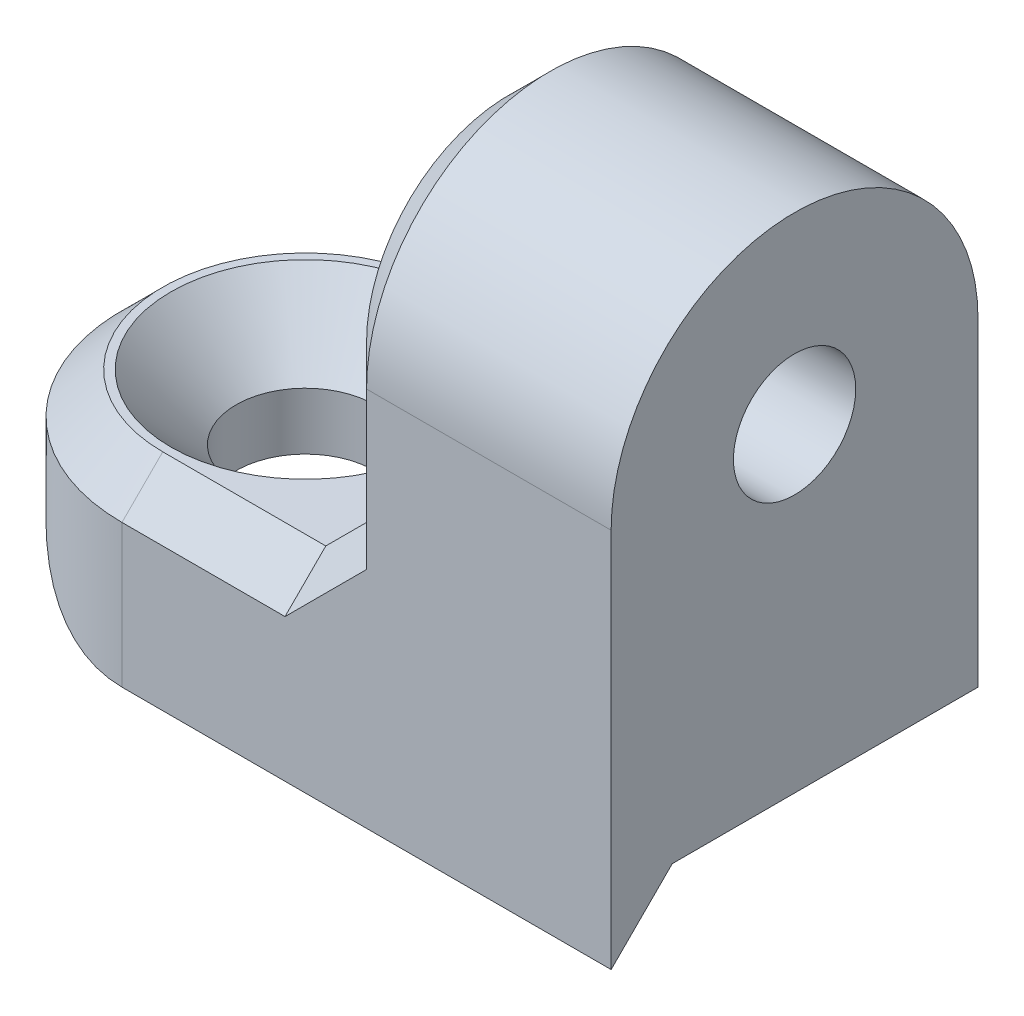
ISO-10303-21;
HEADER;
FILE_DESCRIPTION(('STEP AP214'),'2;1');
FILE_NAME('part.step','',(''),(''),'','','');
FILE_SCHEMA(('AUTOMOTIVE_DESIGN { 1 0 10303 214 1 1 1 1 }'));
ENDSEC;
DATA;
#1=APPLICATION_CONTEXT('core data for automotive mechanical design processes');
#2=APPLICATION_PROTOCOL_DEFINITION('international standard','automotive_design',2000,#1);
#3=PRODUCT_CONTEXT('',#1,'mechanical');
#4=PRODUCT('Part','Part','',(#3));
#5=PRODUCT_RELATED_PRODUCT_CATEGORY('part','',(#4));
#6=PRODUCT_DEFINITION_FORMATION('','',#4);
#7=PRODUCT_DEFINITION_CONTEXT('part definition',#1,'design');
#8=PRODUCT_DEFINITION('design','',#6,#7);
#9=PRODUCT_DEFINITION_SHAPE('','',#8);
#10=(LENGTH_UNIT() NAMED_UNIT(*) SI_UNIT(.MILLI.,.METRE.));
#11=(NAMED_UNIT(*) PLANE_ANGLE_UNIT() SI_UNIT($,.RADIAN.));
#12=(NAMED_UNIT(*) SI_UNIT($,.STERADIAN.) SOLID_ANGLE_UNIT());
#13=UNCERTAINTY_MEASURE_WITH_UNIT(LENGTH_MEASURE(1.E-05),#10,'distance_accuracy_value','');
#14=(GEOMETRIC_REPRESENTATION_CONTEXT(3) GLOBAL_UNCERTAINTY_ASSIGNED_CONTEXT((#13)) GLOBAL_UNIT_ASSIGNED_CONTEXT((#10,
#11,#12)) REPRESENTATION_CONTEXT('',''));
#15=CARTESIAN_POINT('',(0.,0.,0.));
#16=DIRECTION('',(0.,0.,1.));
#17=DIRECTION('',(1.,0.,0.));
#18=AXIS2_PLACEMENT_3D('',#15,#16,#17);
#19=CARTESIAN_POINT('',(0.,3.,4.5));
#20=DIRECTION('',(0.,0.,-1.));
#21=DIRECTION('',(-1.,0.,0.));
#22=AXIS2_PLACEMENT_3D('',#19,#20,#21);
#23=PLANE('',#22);
#24=DIRECTION('',(1.,0.,0.));
#25=VECTOR('',#24,1.);
#26=CARTESIAN_POINT('',(5.,7.83410035786406,4.5));
#27=LINE('',#26,#25);
#28=CARTESIAN_POINT('',(6.,7.83410035786406,4.5));
#29=VERTEX_POINT('',#28);
#30=CARTESIAN_POINT('',(12.,7.83410035786406,4.5));
#31=VERTEX_POINT('',#30);
#32=EDGE_CURVE('E185',#29,#31,#27,.T.);
#33=ORIENTED_EDGE('',*,*,#32,.F.);
#34=DIRECTION('',(0.,-1.,0.));
#35=VECTOR('',#34,1.);
#36=CARTESIAN_POINT('',(6.,3.,4.5));
#37=LINE('',#36,#35);
#38=CARTESIAN_POINT('',(6.,4.,4.5));
#39=VERTEX_POINT('',#38);
#40=EDGE_CURVE('E49',#29,#39,#37,.T.);
#41=ORIENTED_EDGE('',*,*,#40,.T.);
#42=DIRECTION('',(0.707106781186546,0.707106781186549,0.));
#43=VECTOR('',#42,1.);
#44=CARTESIAN_POINT('',(6.,4.,4.5));
#45=LINE('',#44,#43);
#46=CARTESIAN_POINT('',(5.,3.,4.5));
#47=VERTEX_POINT('',#46);
#48=EDGE_CURVE('E259',#47,#39,#45,.T.);
#49=ORIENTED_EDGE('',*,*,#48,.F.);
#50=DIRECTION('',(0.707106781186546,0.707106781186549,0.));
#51=VECTOR('',#50,1.);
#52=CARTESIAN_POINT('',(6.,4.,4.5));
#53=LINE('',#52,#51);
#54=CARTESIAN_POINT('',(4.,2.,4.5));
#55=VERTEX_POINT('',#54);
#56=EDGE_CURVE('E62',#55,#47,#53,.T.);
#57=ORIENTED_EDGE('',*,*,#56,.F.);
#58=DIRECTION('',(-1.,0.,0.));
#59=VECTOR('',#58,1.);
#60=CARTESIAN_POINT('',(0.,2.,4.5));
#61=LINE('',#60,#59);
#62=CARTESIAN_POINT('',(0.,2.,4.5));
#63=VERTEX_POINT('',#62);
#64=EDGE_CURVE('E254',#55,#63,#61,.T.);
#65=ORIENTED_EDGE('',*,*,#64,.T.);
#66=DIRECTION('',(0.,-1.,0.));
#67=VECTOR('',#66,1.);
#68=CARTESIAN_POINT('',(0.,3.,4.5));
#69=LINE('',#68,#67);
#70=CARTESIAN_POINT('',(0.,-1.5,4.5));
#71=VERTEX_POINT('',#70);
#72=EDGE_CURVE('E146',#63,#71,#69,.T.);
#73=ORIENTED_EDGE('',*,*,#72,.T.);
#74=DIRECTION('',(1.,0.,0.));
#75=VECTOR('',#74,1.);
#76=CARTESIAN_POINT('',(-4.501,-1.5,4.5));
#77=LINE('',#76,#75);
#78=CARTESIAN_POINT('',(12.,-1.5,4.5));
#79=VERTEX_POINT('',#78);
#80=EDGE_CURVE('E150',#71,#79,#77,.T.);
#81=ORIENTED_EDGE('',*,*,#80,.T.);
#82=DIRECTION('',(0.,-1.,0.));
#83=VECTOR('',#82,1.);
#84=CARTESIAN_POINT('',(12.,3.,4.5));
#85=LINE('',#84,#83);
#86=EDGE_CURVE('E136',#31,#79,#85,.T.);
#87=ORIENTED_EDGE('',*,*,#86,.F.);
#88=EDGE_LOOP('',(#33,#41,#49,#57,#65,#73,#81,#87));
#89=FACE_BOUND('',#88,.T.);
#90=ADVANCED_FACE('F39',(#89),#23,.F.);
#91=CARTESIAN_POINT('',(0.,0.,0.));
#92=DIRECTION('',(0.,1.,0.));
#93=DIRECTION('',(0.,0.,1.));
#94=AXIS2_PLACEMENT_3D('',#91,#92,#93);
#95=PLANE('',#94);
#96=CARTESIAN_POINT('',(0.,0.,0.));
#97=DIRECTION('',(0.,1.,0.));
#98=DIRECTION('',(0.,0.,1.));
#99=AXIS2_PLACEMENT_3D('',#96,#97,#98);
#100=CIRCLE('',#99,1.7);
#101=CARTESIAN_POINT('',(0.,0.,1.7));
#102=VERTEX_POINT('',#101);
#103=EDGE_CURVE('E161',#102,#102,#100,.T.);
#104=ORIENTED_EDGE('',*,*,#103,.T.);
#105=EDGE_LOOP('',(#104));
#106=FACE_BOUND('',#105,.T.);
#107=DIRECTION('',(1.,0.,0.));
#108=VECTOR('',#107,1.);
#109=CARTESIAN_POINT('',(-4.501,0.,3.));
#110=LINE('',#109,#108);
#111=CARTESIAN_POINT('',(-3.35410196624968,0.,3.));
#112=VERTEX_POINT('',#111);
#113=CARTESIAN_POINT('',(12.,0.,3.));
#114=VERTEX_POINT('',#113);
#115=EDGE_CURVE('E156',#112,#114,#110,.T.);
#116=ORIENTED_EDGE('',*,*,#115,.F.);
#117=CARTESIAN_POINT('',(0.,0.,0.));
#118=DIRECTION('',(0.,1.,0.));
#119=DIRECTION('',(0.,0.,1.));
#120=AXIS2_PLACEMENT_3D('',#117,#118,#119);
#121=CIRCLE('',#120,4.5);
#122=CARTESIAN_POINT('',(0.,0.,-4.5));
#123=VERTEX_POINT('',#122);
#124=EDGE_CURVE('E189',#123,#112,#121,.T.);
#125=ORIENTED_EDGE('',*,*,#124,.F.);
#126=DIRECTION('',(-1.,0.,0.));
#127=VECTOR('',#126,1.);
#128=CARTESIAN_POINT('',(0.,0.,-4.5));
#129=LINE('',#128,#127);
#130=CARTESIAN_POINT('',(12.,0.,-4.5));
#131=VERTEX_POINT('',#130);
#132=EDGE_CURVE('E198',#131,#123,#129,.T.);
#133=ORIENTED_EDGE('',*,*,#132,.F.);
#134=DIRECTION('',(0.,0.,-1.));
#135=VECTOR('',#134,1.);
#136=CARTESIAN_POINT('',(12.,0.,-4.5));
#137=LINE('',#136,#135);
#138=EDGE_CURVE('E195',#114,#131,#137,.T.);
#139=ORIENTED_EDGE('',*,*,#138,.F.);
#140=EDGE_LOOP('',(#116,#125,#133,#139));
#141=FACE_BOUND('',#140,.T.);
#142=ADVANCED_FACE('F327',(#106,#141),#95,.F.);
#143=CARTESIAN_POINT('',(0.,3.,0.));
#144=DIRECTION('',(0.,1.,0.));
#145=DIRECTION('',(0.,0.,1.));
#146=AXIS2_PLACEMENT_3D('',#143,#144,#145);
#147=PLANE('',#146);
#148=DIRECTION('',(0.,0.,-1.));
#149=VECTOR('',#148,1.);
#150=CARTESIAN_POINT('',(4.,3.,0.));
#151=LINE('',#150,#149);
#152=CARTESIAN_POINT('',(4.,3.,3.5));
#153=VERTEX_POINT('',#152);
#154=CARTESIAN_POINT('',(4.,3.,-3.5));
#155=VERTEX_POINT('',#154);
#156=EDGE_CURVE('E244',#153,#155,#151,.T.);
#157=ORIENTED_EDGE('',*,*,#156,.T.);
#158=DIRECTION('',(-1.,0.,0.));
#159=VECTOR('',#158,1.);
#160=CARTESIAN_POINT('',(0.,3.,-3.5));
#161=LINE('',#160,#159);
#162=CARTESIAN_POINT('',(0.,3.,-3.5));
#163=VERTEX_POINT('',#162);
#164=EDGE_CURVE('E250',#155,#163,#161,.T.);
#165=ORIENTED_EDGE('',*,*,#164,.T.);
#166=CARTESIAN_POINT('',(0.,3.,0.));
#167=DIRECTION('',(0.,1.,0.));
#168=DIRECTION('',(0.,0.,1.));
#169=AXIS2_PLACEMENT_3D('',#166,#167,#168);
#170=CIRCLE('',#169,3.5);
#171=CARTESIAN_POINT('',(0.,3.,3.5));
#172=VERTEX_POINT('',#171);
#173=EDGE_CURVE('E247',#163,#172,#170,.T.);
#174=ORIENTED_EDGE('',*,*,#173,.T.);
#175=DIRECTION('',(1.,0.,0.));
#176=VECTOR('',#175,1.);
#177=CARTESIAN_POINT('',(5.,3.,3.5));
#178=LINE('',#177,#176);
#179=EDGE_CURVE('E241',#172,#153,#178,.T.);
#180=ORIENTED_EDGE('',*,*,#179,.T.);
#181=EDGE_LOOP('',(#157,#165,#174,#180));
#182=FACE_BOUND('',#181,.T.);
#183=CARTESIAN_POINT('',(0.,3.,0.));
#184=DIRECTION('',(0.,1.,0.));
#185=DIRECTION('',(0.,0.,1.));
#186=AXIS2_PLACEMENT_3D('',#183,#184,#185);
#187=CIRCLE('',#186,3.3);
#188=CARTESIAN_POINT('',(0.,3.,3.3));
#189=VERTEX_POINT('',#188);
#190=EDGE_CURVE('E300',#189,#189,#187,.T.);
#191=ORIENTED_EDGE('',*,*,#190,.F.);
#192=EDGE_LOOP('',(#191));
#193=FACE_BOUND('',#192,.T.);
#194=ADVANCED_FACE('F332',(#182,#193),#147,.T.);
#195=CARTESIAN_POINT('',(0.,3.,0.));
#196=DIRECTION('',(0.,-1.,0.));
#197=DIRECTION('',(0.,0.,-1.));
#198=AXIS2_PLACEMENT_3D('',#195,#196,#197);
#199=CYLINDRICAL_SURFACE('',#198,4.5);
#200=ORIENTED_EDGE('',*,*,#72,.F.);
#201=CARTESIAN_POINT('',(0.,2.,0.));
#202=DIRECTION('',(0.,1.,0.));
#203=DIRECTION('',(0.,0.,1.));
#204=AXIS2_PLACEMENT_3D('',#201,#202,#203);
#205=CIRCLE('',#204,4.5);
#206=CARTESIAN_POINT('',(0.,2.,-4.5));
#207=VERTEX_POINT('',#206);
#208=EDGE_CURVE('E11',#63,#207,#205,.F.);
#209=ORIENTED_EDGE('',*,*,#208,.T.);
#210=DIRECTION('',(0.,-1.,0.));
#211=VECTOR('',#210,1.);
#212=CARTESIAN_POINT('',(0.,3.,-4.5));
#213=LINE('',#212,#211);
#214=EDGE_CURVE('E202',#207,#123,#213,.T.);
#215=ORIENTED_EDGE('',*,*,#214,.T.);
#216=ORIENTED_EDGE('',*,*,#124,.T.);
#217=CARTESIAN_POINT('',(0.,3.,0.));
#218=DIRECTION('',(0.,-0.707106781186548,-0.707106781186548));
#219=DIRECTION('',(0.,-0.707106781186548,0.707106781186548));
#220=AXIS2_PLACEMENT_3D('',#217,#218,#219);
#221=ELLIPSE('',#220,6.36396103067893,4.5);
#222=EDGE_CURVE('E171',#112,#71,#221,.F.);
#223=ORIENTED_EDGE('',*,*,#222,.T.);
#224=EDGE_LOOP('',(#200,#209,#215,#216,#223));
#225=FACE_BOUND('',#224,.T.);
#226=ADVANCED_FACE('F338',(#225),#199,.T.);
#227=CARTESIAN_POINT('',(12.,3.,-4.5));
#228=DIRECTION('',(-1.,0.,0.));
#229=DIRECTION('',(0.,0.,1.));
#230=AXIS2_PLACEMENT_3D('',#227,#228,#229);
#231=PLANE('',#230);
#232=ORIENTED_EDGE('',*,*,#86,.T.);
#233=DIRECTION('',(0.,0.707106781186548,-0.707106781186548));
#234=VECTOR('',#233,1.);
#235=CARTESIAN_POINT('',(12.,0.,3.));
#236=LINE('',#235,#234);
#237=EDGE_CURVE('E141',#79,#114,#236,.T.);
#238=ORIENTED_EDGE('',*,*,#237,.T.);
#239=ORIENTED_EDGE('',*,*,#138,.T.);
#240=DIRECTION('',(0.,-1.,0.));
#241=VECTOR('',#240,1.);
#242=CARTESIAN_POINT('',(12.,3.,-4.5));
#243=LINE('',#242,#241);
#244=CARTESIAN_POINT('',(12.,7.83410035786406,-4.5));
#245=VERTEX_POINT('',#244);
#246=EDGE_CURVE('E147',#245,#131,#243,.T.);
#247=ORIENTED_EDGE('',*,*,#246,.F.);
#248=CARTESIAN_POINT('',(12.,7.83410035786406,0.));
#249=DIRECTION('',(1.,0.,0.));
#250=DIRECTION('',(0.,0.,-1.));
#251=AXIS2_PLACEMENT_3D('',#248,#249,#250);
#252=CIRCLE('',#251,4.5);
#253=EDGE_CURVE('E144',#245,#31,#252,.T.);
#254=ORIENTED_EDGE('',*,*,#253,.T.);
#255=EDGE_LOOP('',(#232,#238,#239,#247,#254));
#256=FACE_BOUND('',#255,.T.);
#257=CARTESIAN_POINT('',(12.,7.83410035786406,0.));
#258=DIRECTION('',(1.,0.,0.));
#259=DIRECTION('',(0.,0.,-1.));
#260=AXIS2_PLACEMENT_3D('',#257,#258,#259);
#261=CIRCLE('',#260,1.5);
#262=CARTESIAN_POINT('',(12.,7.83410035786406,-1.5));
#263=VERTEX_POINT('',#262);
#264=EDGE_CURVE('E175',#263,#263,#261,.T.);
#265=ORIENTED_EDGE('',*,*,#264,.F.);
#266=EDGE_LOOP('',(#265));
#267=FACE_BOUND('',#266,.T.);
#268=ADVANCED_FACE('F138',(#256,#267),#231,.F.);
#269=CARTESIAN_POINT('',(0.,3.,-4.5));
#270=DIRECTION('',(0.,0.,1.));
#271=DIRECTION('',(1.,0.,0.));
#272=AXIS2_PLACEMENT_3D('',#269,#270,#271);
#273=PLANE('',#272);
#274=DIRECTION('',(-0.707106781186546,-0.707106781186549,0.));
#275=VECTOR('',#274,1.);
#276=CARTESIAN_POINT('',(4.,2.,-4.5));
#277=LINE('',#276,#275);
#278=CARTESIAN_POINT('',(6.,4.,-4.5));
#279=VERTEX_POINT('',#278);
#280=CARTESIAN_POINT('',(5.,3.,-4.5));
#281=VERTEX_POINT('',#280);
#282=EDGE_CURVE('E214',#279,#281,#277,.T.);
#283=ORIENTED_EDGE('',*,*,#282,.F.);
#284=DIRECTION('',(0.,1.,0.));
#285=VECTOR('',#284,1.);
#286=CARTESIAN_POINT('',(6.,3.,-4.5));
#287=LINE('',#286,#285);
#288=CARTESIAN_POINT('',(6.,7.83410035786406,-4.5));
#289=VERTEX_POINT('',#288);
#290=EDGE_CURVE('E221',#279,#289,#287,.T.);
#291=ORIENTED_EDGE('',*,*,#290,.T.);
#292=DIRECTION('',(1.,0.,0.));
#293=VECTOR('',#292,1.);
#294=CARTESIAN_POINT('',(5.,7.83410035786406,-4.5));
#295=LINE('',#294,#293);
#296=EDGE_CURVE('E186',#289,#245,#295,.T.);
#297=ORIENTED_EDGE('',*,*,#296,.T.);
#298=ORIENTED_EDGE('',*,*,#246,.T.);
#299=ORIENTED_EDGE('',*,*,#132,.T.);
#300=ORIENTED_EDGE('',*,*,#214,.F.);
#301=DIRECTION('',(1.,0.,0.));
#302=VECTOR('',#301,1.);
#303=CARTESIAN_POINT('',(5.,2.,-4.5));
#304=LINE('',#303,#302);
#305=CARTESIAN_POINT('',(4.,2.,-4.5));
#306=VERTEX_POINT('',#305);
#307=EDGE_CURVE('E218',#207,#306,#304,.T.);
#308=ORIENTED_EDGE('',*,*,#307,.T.);
#309=DIRECTION('',(-0.707106781186546,-0.707106781186549,0.));
#310=VECTOR('',#309,1.);
#311=CARTESIAN_POINT('',(4.,2.,-4.5));
#312=LINE('',#311,#310);
#313=EDGE_CURVE('E209',#281,#306,#312,.T.);
#314=ORIENTED_EDGE('',*,*,#313,.F.);
#315=EDGE_LOOP('',(#283,#291,#297,#298,#299,#300,#308,#314));
#316=FACE_BOUND('',#315,.T.);
#317=ADVANCED_FACE('F457',(#316),#273,.F.);
#318=CARTESIAN_POINT('',(5.,7.83410035786406,0.));
#319=DIRECTION('',(1.,0.,0.));
#320=DIRECTION('',(0.,0.,-1.));
#321=AXIS2_PLACEMENT_3D('',#318,#319,#320);
#322=CYLINDRICAL_SURFACE('',#321,4.5);
#323=ORIENTED_EDGE('',*,*,#296,.F.);
#324=CARTESIAN_POINT('',(6.,7.83410035786406,0.));
#325=DIRECTION('',(1.,0.,0.));
#326=DIRECTION('',(0.,0.,-1.));
#327=AXIS2_PLACEMENT_3D('',#324,#325,#326);
#328=CIRCLE('',#327,4.5);
#329=EDGE_CURVE('E238',#289,#29,#328,.T.);
#330=ORIENTED_EDGE('',*,*,#329,.T.);
#331=ORIENTED_EDGE('',*,*,#32,.T.);
#332=ORIENTED_EDGE('',*,*,#253,.F.);
#333=EDGE_LOOP('',(#323,#330,#331,#332));
#334=FACE_BOUND('',#333,.T.);
#335=ADVANCED_FACE('F462',(#334),#322,.T.);
#336=CARTESIAN_POINT('',(5.,7.83410035786406,0.));
#337=DIRECTION('',(1.,0.,0.));
#338=DIRECTION('',(0.,0.,-1.));
#339=AXIS2_PLACEMENT_3D('',#336,#337,#338);
#340=PLANE('',#339);
#341=CARTESIAN_POINT('',(5.,7.83410035786406,0.));
#342=DIRECTION('',(1.,0.,0.));
#343=DIRECTION('',(0.,0.,-1.));
#344=AXIS2_PLACEMENT_3D('',#341,#342,#343);
#345=CIRCLE('',#344,3.5);
#346=CARTESIAN_POINT('',(5.,7.83410035786406,3.5));
#347=VERTEX_POINT('',#346);
#348=CARTESIAN_POINT('',(5.,7.83410035786406,-3.5));
#349=VERTEX_POINT('',#348);
#350=EDGE_CURVE('E231',#347,#349,#345,.F.);
#351=ORIENTED_EDGE('',*,*,#350,.T.);
#352=DIRECTION('',(0.,-1.,0.));
#353=VECTOR('',#352,1.);
#354=CARTESIAN_POINT('',(5.,7.83410035786406,-3.5));
#355=LINE('',#354,#353);
#356=CARTESIAN_POINT('',(5.,4.,-3.5));
#357=VERTEX_POINT('',#356);
#358=EDGE_CURVE('E234',#349,#357,#355,.T.);
#359=ORIENTED_EDGE('',*,*,#358,.T.);
#360=DIRECTION('',(0.,0.,1.));
#361=VECTOR('',#360,1.);
#362=CARTESIAN_POINT('',(5.,4.,0.));
#363=LINE('',#362,#361);
#364=CARTESIAN_POINT('',(5.,4.,3.5));
#365=VERTEX_POINT('',#364);
#366=EDGE_CURVE('E225',#357,#365,#363,.T.);
#367=ORIENTED_EDGE('',*,*,#366,.T.);
#368=DIRECTION('',(0.,1.,0.));
#369=VECTOR('',#368,1.);
#370=CARTESIAN_POINT('',(5.,7.83410035786406,3.5));
#371=LINE('',#370,#369);
#372=EDGE_CURVE('E228',#365,#347,#371,.T.);
#373=ORIENTED_EDGE('',*,*,#372,.T.);
#374=EDGE_LOOP('',(#351,#359,#367,#373));
#375=FACE_BOUND('',#374,.T.);
#376=CARTESIAN_POINT('',(5.,7.83410035786406,0.));
#377=DIRECTION('',(1.,0.,0.));
#378=DIRECTION('',(0.,0.,-1.));
#379=AXIS2_PLACEMENT_3D('',#376,#377,#378);
#380=CIRCLE('',#379,1.5);
#381=CARTESIAN_POINT('',(5.,7.83410035786406,-1.5));
#382=VERTEX_POINT('',#381);
#383=EDGE_CURVE('E176',#382,#382,#380,.T.);
#384=ORIENTED_EDGE('',*,*,#383,.T.);
#385=EDGE_LOOP('',(#384));
#386=FACE_BOUND('',#385,.T.);
#387=ADVANCED_FACE('F470',(#375,#386),#340,.F.);
#388=CARTESIAN_POINT('',(5.,7.83410035786406,0.));
#389=DIRECTION('',(1.,0.,0.));
#390=DIRECTION('',(0.,0.,-1.));
#391=AXIS2_PLACEMENT_3D('',#388,#389,#390);
#392=CYLINDRICAL_SURFACE('',#391,1.5);
#393=ORIENTED_EDGE('',*,*,#383,.F.);
#394=EDGE_LOOP('',(#393));
#395=FACE_BOUND('',#394,.T.);
#396=ORIENTED_EDGE('',*,*,#264,.T.);
#397=EDGE_LOOP('',(#396));
#398=FACE_BOUND('',#397,.T.);
#399=ADVANCED_FACE('F479',(#395,#398),#392,.F.);
#400=CARTESIAN_POINT('',(-4.501,0.,3.));
#401=DIRECTION('',(0.,-0.707106781186548,-0.707106781186548));
#402=DIRECTION('',(0.,0.707106781186548,-0.707106781186548));
#403=AXIS2_PLACEMENT_3D('',#400,#401,#402);
#404=PLANE('',#403);
#405=ORIENTED_EDGE('',*,*,#222,.F.);
#406=ORIENTED_EDGE('',*,*,#115,.T.);
#407=ORIENTED_EDGE('',*,*,#237,.F.);
#408=ORIENTED_EDGE('',*,*,#80,.F.);
#409=EDGE_LOOP('',(#405,#406,#407,#408));
#410=FACE_BOUND('',#409,.T.);
#411=ADVANCED_FACE('F159',(#410),#404,.T.);
#412=CARTESIAN_POINT('',(0.,3.,0.));
#413=DIRECTION('',(0.,1.,0.));
#414=DIRECTION('',(0.,0.,1.));
#415=AXIS2_PLACEMENT_3D('',#412,#413,#414);
#416=CYLINDRICAL_SURFACE('',#415,1.7);
#417=CARTESIAN_POINT('',(0.,1.4,0.));
#418=DIRECTION('',(0.,1.,0.));
#419=DIRECTION('',(0.,0.,1.));
#420=AXIS2_PLACEMENT_3D('',#417,#418,#419);
#421=CIRCLE('',#420,1.7);
#422=CARTESIAN_POINT('',(0.,1.4,1.7));
#423=VERTEX_POINT('',#422);
#424=EDGE_CURVE('E165',#423,#423,#421,.T.);
#425=ORIENTED_EDGE('',*,*,#424,.T.);
#426=EDGE_LOOP('',(#425));
#427=FACE_BOUND('',#426,.T.);
#428=ORIENTED_EDGE('',*,*,#103,.F.);
#429=EDGE_LOOP('',(#428));
#430=FACE_BOUND('',#429,.T.);
#431=ADVANCED_FACE('F313',(#427,#430),#416,.F.);
#432=CARTESIAN_POINT('',(0.,3.,0.));
#433=DIRECTION('',(0.,1.,0.));
#434=DIRECTION('',(0.,0.,1.));
#435=AXIS2_PLACEMENT_3D('',#432,#433,#434);
#436=CONICAL_SURFACE('',#435,3.3,0.785398163397448);
#437=ORIENTED_EDGE('',*,*,#424,.F.);
#438=EDGE_LOOP('',(#437));
#439=FACE_BOUND('',#438,.T.);
#440=ORIENTED_EDGE('',*,*,#190,.T.);
#441=EDGE_LOOP('',(#440));
#442=FACE_BOUND('',#441,.T.);
#443=ADVANCED_FACE('F316',(#439,#442),#436,.F.);
#444=CARTESIAN_POINT('',(0.,3.,3.5));
#445=DIRECTION('',(0.,0.707106781186546,0.707106781186549));
#446=DIRECTION('',(-1.,0.,0.));
#447=AXIS2_PLACEMENT_3D('',#444,#445,#446);
#448=PLANE('',#447);
#449=DIRECTION('',(0.,-0.707106781186549,0.707106781186546));
#450=VECTOR('',#449,1.);
#451=CARTESIAN_POINT('',(4.,3.,3.5));
#452=LINE('',#451,#450);
#453=EDGE_CURVE('E292',#153,#55,#452,.T.);
#454=ORIENTED_EDGE('',*,*,#453,.F.);
#455=ORIENTED_EDGE('',*,*,#179,.F.);
#456=DIRECTION('',(0.,0.707106781186549,-0.707106781186546));
#457=VECTOR('',#456,1.);
#458=CARTESIAN_POINT('',(0.,2.,4.5));
#459=LINE('',#458,#457);
#460=EDGE_CURVE('E43',#63,#172,#459,.T.);
#461=ORIENTED_EDGE('',*,*,#460,.F.);
#462=ORIENTED_EDGE('',*,*,#64,.F.);
#463=EDGE_LOOP('',(#454,#455,#461,#462));
#464=FACE_BOUND('',#463,.T.);
#465=ADVANCED_FACE('F41',(#464),#448,.T.);
#466=CARTESIAN_POINT('',(0.,3.,0.));
#467=DIRECTION('',(0.,-1.,0.));
#468=DIRECTION('',(0.,0.,-1.));
#469=AXIS2_PLACEMENT_3D('',#466,#467,#468);
#470=CONICAL_SURFACE('',#469,3.5,0.785398163397447);
#471=ORIENTED_EDGE('',*,*,#460,.T.);
#472=ORIENTED_EDGE('',*,*,#173,.F.);
#473=DIRECTION('',(0.,0.707106781186549,0.707106781186546));
#474=VECTOR('',#473,1.);
#475=CARTESIAN_POINT('',(0.,2.,-4.5));
#476=LINE('',#475,#474);
#477=EDGE_CURVE('E286',#207,#163,#476,.T.);
#478=ORIENTED_EDGE('',*,*,#477,.F.);
#479=ORIENTED_EDGE('',*,*,#208,.F.);
#480=EDGE_LOOP('',(#471,#472,#478,#479));
#481=FACE_BOUND('',#480,.T.);
#482=ADVANCED_FACE('F323',(#481),#470,.T.);
#483=CARTESIAN_POINT('',(5.,4.,3.5));
#484=DIRECTION('',(-0.577350269189626,0.577350269189627,0.577350269189624));
#485=DIRECTION('',(-0.707106781186548,-0.707106781186547,0.));
#486=AXIS2_PLACEMENT_3D('',#483,#484,#485);
#487=PLANE('',#486);
#488=DIRECTION('',(-0.707106781186546,0.,-0.707106781186549));
#489=VECTOR('',#488,1.);
#490=CARTESIAN_POINT('',(6.,4.,4.5));
#491=LINE('',#490,#489);
#492=EDGE_CURVE('E282',#365,#39,#491,.F.);
#493=ORIENTED_EDGE('',*,*,#492,.F.);
#494=DIRECTION('',(-0.707106781186546,-0.707106781186549,0.));
#495=VECTOR('',#494,1.);
#496=CARTESIAN_POINT('',(5.,4.,3.5));
#497=LINE('',#496,#495);
#498=EDGE_CURVE('E289',#153,#365,#497,.F.);
#499=ORIENTED_EDGE('',*,*,#498,.F.);
#500=ORIENTED_EDGE('',*,*,#453,.T.);
#501=ORIENTED_EDGE('',*,*,#56,.T.);
#502=ORIENTED_EDGE('',*,*,#48,.T.);
#503=EDGE_LOOP('',(#493,#499,#500,#501,#502));
#504=FACE_BOUND('',#503,.T.);
#505=ADVANCED_FACE('F365',(#504),#487,.T.);
#506=CARTESIAN_POINT('',(4.,3.,0.));
#507=DIRECTION('',(0.707106781186549,-0.707106781186546,0.));
#508=DIRECTION('',(0.,0.,-1.));
#509=AXIS2_PLACEMENT_3D('',#506,#507,#508);
#510=PLANE('',#509);
#511=ORIENTED_EDGE('',*,*,#498,.T.);
#512=ORIENTED_EDGE('',*,*,#366,.F.);
#513=DIRECTION('',(0.707106781186546,0.707106781186549,0.));
#514=VECTOR('',#513,1.);
#515=CARTESIAN_POINT('',(4.,3.,-3.5));
#516=LINE('',#515,#514);
#517=EDGE_CURVE('E278',#155,#357,#516,.T.);
#518=ORIENTED_EDGE('',*,*,#517,.F.);
#519=ORIENTED_EDGE('',*,*,#156,.F.);
#520=EDGE_LOOP('',(#511,#512,#518,#519));
#521=FACE_BOUND('',#520,.T.);
#522=ADVANCED_FACE('F361',(#521),#510,.F.);
#523=CARTESIAN_POINT('',(0.,3.,-3.5));
#524=DIRECTION('',(0.,0.707106781186546,-0.707106781186549));
#525=DIRECTION('',(1.,0.,0.));
#526=AXIS2_PLACEMENT_3D('',#523,#524,#525);
#527=PLANE('',#526);
#528=ORIENTED_EDGE('',*,*,#477,.T.);
#529=ORIENTED_EDGE('',*,*,#164,.F.);
#530=DIRECTION('',(0.,0.707106781186549,0.707106781186546));
#531=VECTOR('',#530,1.);
#532=CARTESIAN_POINT('',(4.,2.,-4.5));
#533=LINE('',#532,#531);
#534=EDGE_CURVE('E274',#306,#155,#533,.T.);
#535=ORIENTED_EDGE('',*,*,#534,.F.);
#536=ORIENTED_EDGE('',*,*,#307,.F.);
#537=EDGE_LOOP('',(#528,#529,#535,#536));
#538=FACE_BOUND('',#537,.T.);
#539=ADVANCED_FACE('F357',(#538),#527,.T.);
#540=CARTESIAN_POINT('',(6.,3.,4.5));
#541=DIRECTION('',(0.707106781186549,0.,-0.707106781186546));
#542=DIRECTION('',(0.,-1.,0.));
#543=AXIS2_PLACEMENT_3D('',#540,#541,#542);
#544=PLANE('',#543);
#545=ORIENTED_EDGE('',*,*,#492,.T.);
#546=ORIENTED_EDGE('',*,*,#40,.F.);
#547=DIRECTION('',(0.707106781186546,0.,0.707106781186549));
#548=VECTOR('',#547,1.);
#549=CARTESIAN_POINT('',(5.,7.83410035786406,3.5));
#550=LINE('',#549,#548);
#551=EDGE_CURVE('E270',#347,#29,#550,.T.);
#552=ORIENTED_EDGE('',*,*,#551,.F.);
#553=ORIENTED_EDGE('',*,*,#372,.F.);
#554=EDGE_LOOP('',(#545,#546,#552,#553));
#555=FACE_BOUND('',#554,.T.);
#556=ADVANCED_FACE('F353',(#555),#544,.F.);
#557=CARTESIAN_POINT('',(4.,3.,-3.5));
#558=DIRECTION('',(-0.577350269189626,0.577350269189624,-0.577350269189626));
#559=DIRECTION('',(-0.707106781186547,0.,0.707106781186547));
#560=AXIS2_PLACEMENT_3D('',#557,#558,#559);
#561=PLANE('',#560);
#562=ORIENTED_EDGE('',*,*,#534,.T.);
#563=ORIENTED_EDGE('',*,*,#517,.T.);
#564=DIRECTION('',(0.707106781186549,0.,-0.707106781186546));
#565=VECTOR('',#564,1.);
#566=CARTESIAN_POINT('',(5.,4.,-3.5));
#567=LINE('',#566,#565);
#568=EDGE_CURVE('E267',#279,#357,#567,.F.);
#569=ORIENTED_EDGE('',*,*,#568,.F.);
#570=ORIENTED_EDGE('',*,*,#282,.T.);
#571=ORIENTED_EDGE('',*,*,#313,.T.);
#572=EDGE_LOOP('',(#562,#563,#569,#570,#571));
#573=FACE_BOUND('',#572,.T.);
#574=ADVANCED_FACE('F349',(#573),#561,.T.);
#575=CARTESIAN_POINT('',(6.,7.83410035786406,0.));
#576=DIRECTION('',(1.,0.,0.));
#577=DIRECTION('',(0.,0.,-1.));
#578=AXIS2_PLACEMENT_3D('',#575,#576,#577);
#579=CONICAL_SURFACE('',#578,4.5,0.78539816339745);
#580=ORIENTED_EDGE('',*,*,#551,.T.);
#581=ORIENTED_EDGE('',*,*,#329,.F.);
#582=DIRECTION('',(0.707106781186546,0.,-0.707106781186549));
#583=VECTOR('',#582,1.);
#584=CARTESIAN_POINT('',(5.,7.83410035786406,-3.5));
#585=LINE('',#584,#583);
#586=EDGE_CURVE('E264',#349,#289,#585,.T.);
#587=ORIENTED_EDGE('',*,*,#586,.F.);
#588=ORIENTED_EDGE('',*,*,#350,.F.);
#589=EDGE_LOOP('',(#580,#581,#587,#588));
#590=FACE_BOUND('',#589,.T.);
#591=ADVANCED_FACE('F345',(#590),#579,.T.);
#592=CARTESIAN_POINT('',(6.,3.,-4.5));
#593=DIRECTION('',(0.707106781186546,0.,0.707106781186549));
#594=DIRECTION('',(0.,1.,0.));
#595=AXIS2_PLACEMENT_3D('',#592,#593,#594);
#596=PLANE('',#595);
#597=ORIENTED_EDGE('',*,*,#568,.T.);
#598=ORIENTED_EDGE('',*,*,#358,.F.);
#599=ORIENTED_EDGE('',*,*,#586,.T.);
#600=ORIENTED_EDGE('',*,*,#290,.F.);
#601=EDGE_LOOP('',(#597,#598,#599,#600));
#602=FACE_BOUND('',#601,.T.);
#603=ADVANCED_FACE('F342',(#602),#596,.F.);
#604=CLOSED_SHELL('',(#90,#142,#194,#226,#268,#317,#335,#387,#399,#411,#431,#443,#465,#482,#505,
#522,#539,#556,#574,#591,#603));
#605=MANIFOLD_SOLID_BREP('B2',#604);
#606=ADVANCED_BREP_SHAPE_REPRESENTATION('',(#18,#605),#14);
#607=SHAPE_DEFINITION_REPRESENTATION(#9,#606);
ENDSEC;
END-ISO-10303-21;
